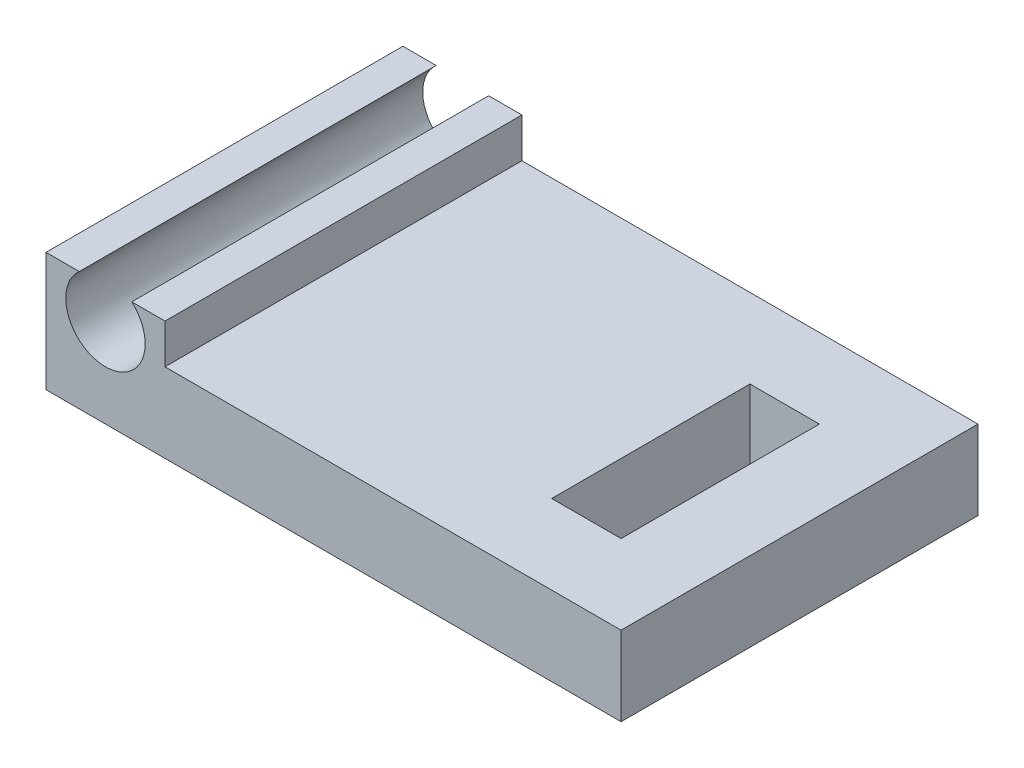
ISO-10303-21;
HEADER;
FILE_DESCRIPTION(('STEP AP214'),'2;1');
FILE_NAME('part.step','',(''),(''),'','','');
FILE_SCHEMA(('AUTOMOTIVE_DESIGN { 1 0 10303 214 1 1 1 1 }'));
ENDSEC;
DATA;
#1=APPLICATION_CONTEXT('core data for automotive mechanical design processes');
#2=APPLICATION_PROTOCOL_DEFINITION('international standard','automotive_design',2000,#1);
#3=PRODUCT_CONTEXT('',#1,'mechanical');
#4=PRODUCT('Part','Part','',(#3));
#5=PRODUCT_RELATED_PRODUCT_CATEGORY('part','',(#4));
#6=PRODUCT_DEFINITION_FORMATION('','',#4);
#7=PRODUCT_DEFINITION_CONTEXT('part definition',#1,'design');
#8=PRODUCT_DEFINITION('design','',#6,#7);
#9=PRODUCT_DEFINITION_SHAPE('','',#8);
#10=(LENGTH_UNIT() NAMED_UNIT(*) SI_UNIT(.MILLI.,.METRE.));
#11=(NAMED_UNIT(*) PLANE_ANGLE_UNIT() SI_UNIT($,.RADIAN.));
#12=(NAMED_UNIT(*) SI_UNIT($,.STERADIAN.) SOLID_ANGLE_UNIT());
#13=UNCERTAINTY_MEASURE_WITH_UNIT(LENGTH_MEASURE(1.E-05),#10,'distance_accuracy_value','');
#14=(GEOMETRIC_REPRESENTATION_CONTEXT(3) GLOBAL_UNCERTAINTY_ASSIGNED_CONTEXT((#13)) GLOBAL_UNIT_ASSIGNED_CONTEXT((#10,
#11,#12)) REPRESENTATION_CONTEXT('',''));
#15=CARTESIAN_POINT('',(0.,0.,0.));
#16=DIRECTION('',(0.,0.,1.));
#17=DIRECTION('',(1.,0.,0.));
#18=AXIS2_PLACEMENT_3D('',#15,#16,#17);
#19=CARTESIAN_POINT('',(0.,3.048,0.));
#20=DIRECTION('',(0.,1.,0.));
#21=DIRECTION('',(0.,0.,1.));
#22=AXIS2_PLACEMENT_3D('',#19,#20,#21);
#23=PLANE('',#22);
#24=DIRECTION('',(0.,0.,1.));
#25=VECTOR('',#24,1.);
#26=CARTESIAN_POINT('',(-6.5140208330104,3.048,-4.572));
#27=LINE('',#26,#25);
#28=CARTESIAN_POINT('',(-6.5140208330104,3.048,-4.572));
#29=VERTEX_POINT('',#28);
#30=CARTESIAN_POINT('',(-6.5140208330104,3.048,4.572));
#31=VERTEX_POINT('',#30);
#32=EDGE_CURVE('E11',#29,#31,#27,.T.);
#33=ORIENTED_EDGE('',*,*,#32,.F.);
#34=DIRECTION('',(-1.,0.,0.));
#35=VECTOR('',#34,1.);
#36=CARTESIAN_POINT('',(-7.366,3.048,-4.572));
#37=LINE('',#36,#35);
#38=CARTESIAN_POINT('',(-7.366,3.048,-4.572));
#39=VERTEX_POINT('',#38);
#40=EDGE_CURVE('E139',#29,#39,#37,.T.);
#41=ORIENTED_EDGE('',*,*,#40,.T.);
#42=DIRECTION('',(0.,0.,1.));
#43=VECTOR('',#42,1.);
#44=CARTESIAN_POINT('',(-7.366,3.048,-4.572));
#45=LINE('',#44,#43);
#46=CARTESIAN_POINT('',(-7.366,3.048,4.572));
#47=VERTEX_POINT('',#46);
#48=EDGE_CURVE('E136',#39,#47,#45,.T.);
#49=ORIENTED_EDGE('',*,*,#48,.T.);
#50=DIRECTION('',(1.,0.,0.));
#51=VECTOR('',#50,1.);
#52=CARTESIAN_POINT('',(-7.366,3.048,4.572));
#53=LINE('',#52,#51);
#54=EDGE_CURVE('E130',#47,#31,#53,.T.);
#55=ORIENTED_EDGE('',*,*,#54,.T.);
#56=EDGE_LOOP('',(#33,#41,#49,#55));
#57=FACE_BOUND('',#56,.T.);
#58=ADVANCED_FACE('F33',(#57),#23,.T.);
#59=CARTESIAN_POINT('',(0.,2.032,0.));
#60=DIRECTION('',(0.,1.,0.));
#61=DIRECTION('',(0.,0.,1.));
#62=AXIS2_PLACEMENT_3D('',#59,#60,#61);
#63=PLANE('',#62);
#64=DIRECTION('',(0.,0.,-1.));
#65=VECTOR('',#64,1.);
#66=CARTESIAN_POINT('',(-4.318,2.032,-4.572));
#67=LINE('',#66,#65);
#68=CARTESIAN_POINT('',(-4.318,2.032,4.572));
#69=VERTEX_POINT('',#68);
#70=CARTESIAN_POINT('',(-4.318,2.032,-4.572));
#71=VERTEX_POINT('',#70);
#72=EDGE_CURVE('E55',#69,#71,#67,.T.);
#73=ORIENTED_EDGE('',*,*,#72,.F.);
#74=DIRECTION('',(1.,0.,0.));
#75=VECTOR('',#74,1.);
#76=CARTESIAN_POINT('',(-7.366,2.032,4.572));
#77=LINE('',#76,#75);
#78=CARTESIAN_POINT('',(7.366,2.032,4.572));
#79=VERTEX_POINT('',#78);
#80=EDGE_CURVE('E191',#69,#79,#77,.T.);
#81=ORIENTED_EDGE('',*,*,#80,.T.);
#82=DIRECTION('',(0.,0.,-1.));
#83=VECTOR('',#82,1.);
#84=CARTESIAN_POINT('',(7.366,2.032,-4.572));
#85=LINE('',#84,#83);
#86=CARTESIAN_POINT('',(7.366,2.032,-4.572));
#87=VERTEX_POINT('',#86);
#88=EDGE_CURVE('E185',#79,#87,#85,.T.);
#89=ORIENTED_EDGE('',*,*,#88,.T.);
#90=DIRECTION('',(-1.,0.,0.));
#91=VECTOR('',#90,1.);
#92=CARTESIAN_POINT('',(-7.366,2.032,-4.572));
#93=LINE('',#92,#91);
#94=EDGE_CURVE('E188',#87,#71,#93,.T.);
#95=ORIENTED_EDGE('',*,*,#94,.T.);
#96=EDGE_LOOP('',(#73,#81,#89,#95));
#97=FACE_BOUND('',#96,.T.);
#98=DIRECTION('',(1.,0.,0.));
#99=VECTOR('',#98,1.);
#100=CARTESIAN_POINT('',(3.556,2.032,2.54));
#101=LINE('',#100,#99);
#102=CARTESIAN_POINT('',(3.556,2.032,2.54));
#103=VERTEX_POINT('',#102);
#104=CARTESIAN_POINT('',(5.334,2.032,2.54));
#105=VERTEX_POINT('',#104);
#106=EDGE_CURVE('E156',#103,#105,#101,.T.);
#107=ORIENTED_EDGE('',*,*,#106,.F.);
#108=DIRECTION('',(0.,0.,1.));
#109=VECTOR('',#108,1.);
#110=CARTESIAN_POINT('',(3.556,2.032,-2.54));
#111=LINE('',#110,#109);
#112=CARTESIAN_POINT('',(3.556,2.032,-2.54));
#113=VERTEX_POINT('',#112);
#114=EDGE_CURVE('E154',#113,#103,#111,.T.);
#115=ORIENTED_EDGE('',*,*,#114,.F.);
#116=DIRECTION('',(-1.,0.,0.));
#117=VECTOR('',#116,1.);
#118=CARTESIAN_POINT('',(3.556,2.032,-2.54));
#119=LINE('',#118,#117);
#120=CARTESIAN_POINT('',(5.334,2.032,-2.54));
#121=VERTEX_POINT('',#120);
#122=EDGE_CURVE('E162',#121,#113,#119,.T.);
#123=ORIENTED_EDGE('',*,*,#122,.F.);
#124=DIRECTION('',(0.,0.,-1.));
#125=VECTOR('',#124,1.);
#126=CARTESIAN_POINT('',(5.334,2.032,-2.54));
#127=LINE('',#126,#125);
#128=EDGE_CURVE('E159',#105,#121,#127,.T.);
#129=ORIENTED_EDGE('',*,*,#128,.F.);
#130=EDGE_LOOP('',(#107,#115,#123,#129));
#131=FACE_BOUND('',#130,.T.);
#132=ADVANCED_FACE('F223',(#97,#131),#63,.T.);
#133=CARTESIAN_POINT('',(0.,0.,0.));
#134=DIRECTION('',(0.,1.,0.));
#135=DIRECTION('',(0.,0.,1.));
#136=AXIS2_PLACEMENT_3D('',#133,#134,#135);
#137=PLANE('',#136);
#138=DIRECTION('',(0.,0.,-1.));
#139=VECTOR('',#138,1.);
#140=CARTESIAN_POINT('',(7.366,0.,-4.572));
#141=LINE('',#140,#139);
#142=CARTESIAN_POINT('',(7.366,0.,4.572));
#143=VERTEX_POINT('',#142);
#144=CARTESIAN_POINT('',(7.366,0.,-4.572));
#145=VERTEX_POINT('',#144);
#146=EDGE_CURVE('E184',#143,#145,#141,.T.);
#147=ORIENTED_EDGE('',*,*,#146,.F.);
#148=DIRECTION('',(1.,0.,0.));
#149=VECTOR('',#148,1.);
#150=CARTESIAN_POINT('',(-7.366,0.,4.572));
#151=LINE('',#150,#149);
#152=CARTESIAN_POINT('',(-7.366,0.,4.572));
#153=VERTEX_POINT('',#152);
#154=EDGE_CURVE('E189',#153,#143,#151,.T.);
#155=ORIENTED_EDGE('',*,*,#154,.F.);
#156=DIRECTION('',(0.,0.,1.));
#157=VECTOR('',#156,1.);
#158=CARTESIAN_POINT('',(-7.366,0.,-4.572));
#159=LINE('',#158,#157);
#160=CARTESIAN_POINT('',(-7.366,0.,-4.572));
#161=VERTEX_POINT('',#160);
#162=EDGE_CURVE('E198',#161,#153,#159,.T.);
#163=ORIENTED_EDGE('',*,*,#162,.F.);
#164=DIRECTION('',(-1.,0.,0.));
#165=VECTOR('',#164,1.);
#166=CARTESIAN_POINT('',(-7.366,0.,-4.572));
#167=LINE('',#166,#165);
#168=EDGE_CURVE('E196',#145,#161,#167,.T.);
#169=ORIENTED_EDGE('',*,*,#168,.F.);
#170=EDGE_LOOP('',(#147,#155,#163,#169));
#171=FACE_BOUND('',#170,.T.);
#172=DIRECTION('',(0.,0.,1.));
#173=VECTOR('',#172,1.);
#174=CARTESIAN_POINT('',(3.556,0.,-2.54));
#175=LINE('',#174,#173);
#176=CARTESIAN_POINT('',(3.556,0.,-2.54));
#177=VERTEX_POINT('',#176);
#178=CARTESIAN_POINT('',(3.556,0.,2.54));
#179=VERTEX_POINT('',#178);
#180=EDGE_CURVE('E153',#177,#179,#175,.T.);
#181=ORIENTED_EDGE('',*,*,#180,.T.);
#182=DIRECTION('',(1.,0.,0.));
#183=VECTOR('',#182,1.);
#184=CARTESIAN_POINT('',(3.556,0.,2.54));
#185=LINE('',#184,#183);
#186=CARTESIAN_POINT('',(5.334,0.,2.54));
#187=VERTEX_POINT('',#186);
#188=EDGE_CURVE('E167',#179,#187,#185,.T.);
#189=ORIENTED_EDGE('',*,*,#188,.T.);
#190=DIRECTION('',(0.,0.,-1.));
#191=VECTOR('',#190,1.);
#192=CARTESIAN_POINT('',(5.334,0.,-2.54));
#193=LINE('',#192,#191);
#194=CARTESIAN_POINT('',(5.334,0.,-2.54));
#195=VERTEX_POINT('',#194);
#196=EDGE_CURVE('E170',#187,#195,#193,.T.);
#197=ORIENTED_EDGE('',*,*,#196,.T.);
#198=DIRECTION('',(-1.,0.,0.));
#199=VECTOR('',#198,1.);
#200=CARTESIAN_POINT('',(3.556,0.,-2.54));
#201=LINE('',#200,#199);
#202=EDGE_CURVE('E157',#195,#177,#201,.T.);
#203=ORIENTED_EDGE('',*,*,#202,.T.);
#204=EDGE_LOOP('',(#181,#189,#197,#203));
#205=FACE_BOUND('',#204,.T.);
#206=ADVANCED_FACE('F230',(#171,#205),#137,.F.);
#207=CARTESIAN_POINT('',(7.366,2.032,-4.572));
#208=DIRECTION('',(-1.,0.,0.));
#209=DIRECTION('',(0.,0.,1.));
#210=AXIS2_PLACEMENT_3D('',#207,#208,#209);
#211=PLANE('',#210);
#212=ORIENTED_EDGE('',*,*,#146,.T.);
#213=DIRECTION('',(0.,-1.,0.));
#214=VECTOR('',#213,1.);
#215=CARTESIAN_POINT('',(7.366,2.032,-4.572));
#216=LINE('',#215,#214);
#217=EDGE_CURVE('E208',#87,#145,#216,.T.);
#218=ORIENTED_EDGE('',*,*,#217,.F.);
#219=ORIENTED_EDGE('',*,*,#88,.F.);
#220=DIRECTION('',(0.,-1.,0.));
#221=VECTOR('',#220,1.);
#222=CARTESIAN_POINT('',(7.366,2.032,4.572));
#223=LINE('',#222,#221);
#224=EDGE_CURVE('E193',#79,#143,#223,.T.);
#225=ORIENTED_EDGE('',*,*,#224,.T.);
#226=EDGE_LOOP('',(#212,#218,#219,#225));
#227=FACE_BOUND('',#226,.T.);
#228=ADVANCED_FACE('F35',(#227),#211,.F.);
#229=CARTESIAN_POINT('',(-7.366,2.032,-4.572));
#230=DIRECTION('',(0.,0.,1.));
#231=DIRECTION('',(1.,0.,0.));
#232=AXIS2_PLACEMENT_3D('',#229,#230,#231);
#233=PLANE('',#232);
#234=ORIENTED_EDGE('',*,*,#40,.F.);
#235=CARTESIAN_POINT('',(-5.842,2.286,-4.572));
#236=DIRECTION('',(0.,0.,1.));
#237=DIRECTION('',(1.,0.,0.));
#238=AXIS2_PLACEMENT_3D('',#235,#236,#237);
#239=CIRCLE('',#238,1.016);
#240=CARTESIAN_POINT('',(-5.16997916698959,3.048,-4.572));
#241=VERTEX_POINT('',#240);
#242=EDGE_CURVE('E121',#29,#241,#239,.T.);
#243=ORIENTED_EDGE('',*,*,#242,.T.);
#244=CARTESIAN_POINT('',(-4.318,3.048,-4.572));
#245=VERTEX_POINT('',#244);
#246=EDGE_CURVE('E143',#245,#241,#37,.T.);
#247=ORIENTED_EDGE('',*,*,#246,.F.);
#248=DIRECTION('',(0.,-1.,0.));
#249=VECTOR('',#248,1.);
#250=CARTESIAN_POINT('',(-4.318,3.048,-4.572));
#251=LINE('',#250,#249);
#252=EDGE_CURVE('E146',#245,#71,#251,.T.);
#253=ORIENTED_EDGE('',*,*,#252,.T.);
#254=ORIENTED_EDGE('',*,*,#94,.F.);
#255=ORIENTED_EDGE('',*,*,#217,.T.);
#256=ORIENTED_EDGE('',*,*,#168,.T.);
#257=DIRECTION('',(0.,-1.,0.));
#258=VECTOR('',#257,1.);
#259=CARTESIAN_POINT('',(-7.366,2.032,-4.572));
#260=LINE('',#259,#258);
#261=EDGE_CURVE('E205',#39,#161,#260,.T.);
#262=ORIENTED_EDGE('',*,*,#261,.F.);
#263=EDGE_LOOP('',(#234,#243,#247,#253,#254,#255,#256,#262));
#264=FACE_BOUND('',#263,.T.);
#265=ADVANCED_FACE('F213',(#264),#233,.F.);
#266=CARTESIAN_POINT('',(-7.366,2.032,-4.572));
#267=DIRECTION('',(1.,0.,0.));
#268=DIRECTION('',(0.,0.,-1.));
#269=AXIS2_PLACEMENT_3D('',#266,#267,#268);
#270=PLANE('',#269);
#271=ORIENTED_EDGE('',*,*,#162,.T.);
#272=DIRECTION('',(0.,-1.,0.));
#273=VECTOR('',#272,1.);
#274=CARTESIAN_POINT('',(-7.366,2.032,4.572));
#275=LINE('',#274,#273);
#276=EDGE_CURVE('E203',#47,#153,#275,.T.);
#277=ORIENTED_EDGE('',*,*,#276,.F.);
#278=ORIENTED_EDGE('',*,*,#48,.F.);
#279=ORIENTED_EDGE('',*,*,#261,.T.);
#280=EDGE_LOOP('',(#271,#277,#278,#279));
#281=FACE_BOUND('',#280,.T.);
#282=ADVANCED_FACE('F234',(#281),#270,.F.);
#283=CARTESIAN_POINT('',(-7.366,2.032,4.572));
#284=DIRECTION('',(0.,0.,-1.));
#285=DIRECTION('',(-1.,0.,0.));
#286=AXIS2_PLACEMENT_3D('',#283,#284,#285);
#287=PLANE('',#286);
#288=CARTESIAN_POINT('',(-5.16997916698959,3.048,4.572));
#289=VERTEX_POINT('',#288);
#290=CARTESIAN_POINT('',(-4.318,3.048,4.572));
#291=VERTEX_POINT('',#290);
#292=EDGE_CURVE('E133',#289,#291,#53,.T.);
#293=ORIENTED_EDGE('',*,*,#292,.F.);
#294=CARTESIAN_POINT('',(-5.842,2.286,4.572));
#295=DIRECTION('',(0.,0.,1.));
#296=DIRECTION('',(1.,0.,0.));
#297=AXIS2_PLACEMENT_3D('',#294,#295,#296);
#298=CIRCLE('',#297,1.016);
#299=EDGE_CURVE('E47',#31,#289,#298,.T.);
#300=ORIENTED_EDGE('',*,*,#299,.F.);
#301=ORIENTED_EDGE('',*,*,#54,.F.);
#302=ORIENTED_EDGE('',*,*,#276,.T.);
#303=ORIENTED_EDGE('',*,*,#154,.T.);
#304=ORIENTED_EDGE('',*,*,#224,.F.);
#305=ORIENTED_EDGE('',*,*,#80,.F.);
#306=DIRECTION('',(0.,-1.,0.));
#307=VECTOR('',#306,1.);
#308=CARTESIAN_POINT('',(-4.318,3.048,4.572));
#309=LINE('',#308,#307);
#310=EDGE_CURVE('E150',#291,#69,#309,.T.);
#311=ORIENTED_EDGE('',*,*,#310,.F.);
#312=EDGE_LOOP('',(#293,#300,#301,#302,#303,#304,#305,#311));
#313=FACE_BOUND('',#312,.T.);
#314=ADVANCED_FACE('F128',(#313),#287,.F.);
#315=CARTESIAN_POINT('',(3.556,2.032,-2.54));
#316=DIRECTION('',(1.,0.,0.));
#317=DIRECTION('',(0.,0.,-1.));
#318=AXIS2_PLACEMENT_3D('',#315,#316,#317);
#319=PLANE('',#318);
#320=ORIENTED_EDGE('',*,*,#180,.F.);
#321=DIRECTION('',(0.,-1.,0.));
#322=VECTOR('',#321,1.);
#323=CARTESIAN_POINT('',(3.556,2.032,-2.54));
#324=LINE('',#323,#322);
#325=EDGE_CURVE('E164',#113,#177,#324,.T.);
#326=ORIENTED_EDGE('',*,*,#325,.F.);
#327=ORIENTED_EDGE('',*,*,#114,.T.);
#328=DIRECTION('',(0.,-1.,0.));
#329=VECTOR('',#328,1.);
#330=CARTESIAN_POINT('',(3.556,2.032,2.54));
#331=LINE('',#330,#329);
#332=EDGE_CURVE('E181',#103,#179,#331,.T.);
#333=ORIENTED_EDGE('',*,*,#332,.T.);
#334=EDGE_LOOP('',(#320,#326,#327,#333));
#335=FACE_BOUND('',#334,.T.);
#336=ADVANCED_FACE('F241',(#335),#319,.T.);
#337=CARTESIAN_POINT('',(3.556,2.032,2.54));
#338=DIRECTION('',(0.,0.,-1.));
#339=DIRECTION('',(-1.,0.,0.));
#340=AXIS2_PLACEMENT_3D('',#337,#338,#339);
#341=PLANE('',#340);
#342=ORIENTED_EDGE('',*,*,#188,.F.);
#343=ORIENTED_EDGE('',*,*,#332,.F.);
#344=ORIENTED_EDGE('',*,*,#106,.T.);
#345=DIRECTION('',(0.,-1.,0.));
#346=VECTOR('',#345,1.);
#347=CARTESIAN_POINT('',(5.334,2.032,2.54));
#348=LINE('',#347,#346);
#349=EDGE_CURVE('E179',#105,#187,#348,.T.);
#350=ORIENTED_EDGE('',*,*,#349,.T.);
#351=EDGE_LOOP('',(#342,#343,#344,#350));
#352=FACE_BOUND('',#351,.T.);
#353=ADVANCED_FACE('F266',(#352),#341,.T.);
#354=CARTESIAN_POINT('',(5.334,2.032,-2.54));
#355=DIRECTION('',(-1.,0.,0.));
#356=DIRECTION('',(0.,0.,1.));
#357=AXIS2_PLACEMENT_3D('',#354,#355,#356);
#358=PLANE('',#357);
#359=ORIENTED_EDGE('',*,*,#196,.F.);
#360=ORIENTED_EDGE('',*,*,#349,.F.);
#361=ORIENTED_EDGE('',*,*,#128,.T.);
#362=DIRECTION('',(0.,-1.,0.));
#363=VECTOR('',#362,1.);
#364=CARTESIAN_POINT('',(5.334,2.032,-2.54));
#365=LINE('',#364,#363);
#366=EDGE_CURVE('E177',#121,#195,#365,.T.);
#367=ORIENTED_EDGE('',*,*,#366,.T.);
#368=EDGE_LOOP('',(#359,#360,#361,#367));
#369=FACE_BOUND('',#368,.T.);
#370=ADVANCED_FACE('F260',(#369),#358,.T.);
#371=CARTESIAN_POINT('',(3.556,2.032,-2.54));
#372=DIRECTION('',(0.,0.,1.));
#373=DIRECTION('',(1.,0.,0.));
#374=AXIS2_PLACEMENT_3D('',#371,#372,#373);
#375=PLANE('',#374);
#376=ORIENTED_EDGE('',*,*,#202,.F.);
#377=ORIENTED_EDGE('',*,*,#366,.F.);
#378=ORIENTED_EDGE('',*,*,#122,.T.);
#379=ORIENTED_EDGE('',*,*,#325,.T.);
#380=EDGE_LOOP('',(#376,#377,#378,#379));
#381=FACE_BOUND('',#380,.T.);
#382=ADVANCED_FACE('F256',(#381),#375,.T.);
#383=CARTESIAN_POINT('',(-4.318,3.048,-4.572));
#384=DIRECTION('',(-1.,0.,0.));
#385=DIRECTION('',(0.,0.,1.));
#386=AXIS2_PLACEMENT_3D('',#383,#384,#385);
#387=PLANE('',#386);
#388=ORIENTED_EDGE('',*,*,#72,.T.);
#389=ORIENTED_EDGE('',*,*,#252,.F.);
#390=DIRECTION('',(0.,0.,-1.));
#391=VECTOR('',#390,1.);
#392=CARTESIAN_POINT('',(-4.318,3.048,-4.572));
#393=LINE('',#392,#391);
#394=EDGE_CURVE('E137',#291,#245,#393,.T.);
#395=ORIENTED_EDGE('',*,*,#394,.F.);
#396=ORIENTED_EDGE('',*,*,#310,.T.);
#397=EDGE_LOOP('',(#388,#389,#395,#396));
#398=FACE_BOUND('',#397,.T.);
#399=ADVANCED_FACE('F220',(#398),#387,.F.);
#400=DIRECTION('',(0.,0.,1.));
#401=VECTOR('',#400,1.);
#402=CARTESIAN_POINT('',(-5.16997916698959,3.048,-4.572));
#403=LINE('',#402,#401);
#404=EDGE_CURVE('E41',#289,#241,#403,.F.);
#405=ORIENTED_EDGE('',*,*,#404,.F.);
#406=ORIENTED_EDGE('',*,*,#292,.T.);
#407=ORIENTED_EDGE('',*,*,#394,.T.);
#408=ORIENTED_EDGE('',*,*,#246,.T.);
#409=EDGE_LOOP('',(#405,#406,#407,#408));
#410=FACE_BOUND('',#409,.T.);
#411=ADVANCED_FACE('F216',(#410),#23,.T.);
#412=CARTESIAN_POINT('',(-5.842,2.286,-4.572));
#413=DIRECTION('',(0.,0.,1.));
#414=DIRECTION('',(1.,0.,0.));
#415=AXIS2_PLACEMENT_3D('',#412,#413,#414);
#416=CYLINDRICAL_SURFACE('',#415,1.016);
#417=ORIENTED_EDGE('',*,*,#32,.T.);
#418=ORIENTED_EDGE('',*,*,#299,.T.);
#419=ORIENTED_EDGE('',*,*,#404,.T.);
#420=ORIENTED_EDGE('',*,*,#242,.F.);
#421=EDGE_LOOP('',(#417,#418,#419,#420));
#422=FACE_BOUND('',#421,.T.);
#423=ADVANCED_FACE('F119',(#422),#416,.F.);
#424=CLOSED_SHELL('',(#58,#132,#206,#228,#265,#282,#314,#336,#353,#370,#382,#399,#411,#423));
#425=MANIFOLD_SOLID_BREP('B2',#424);
#426=ADVANCED_BREP_SHAPE_REPRESENTATION('',(#18,#425),#14);
#427=SHAPE_DEFINITION_REPRESENTATION(#9,#426);
ENDSEC;
END-ISO-10303-21;
